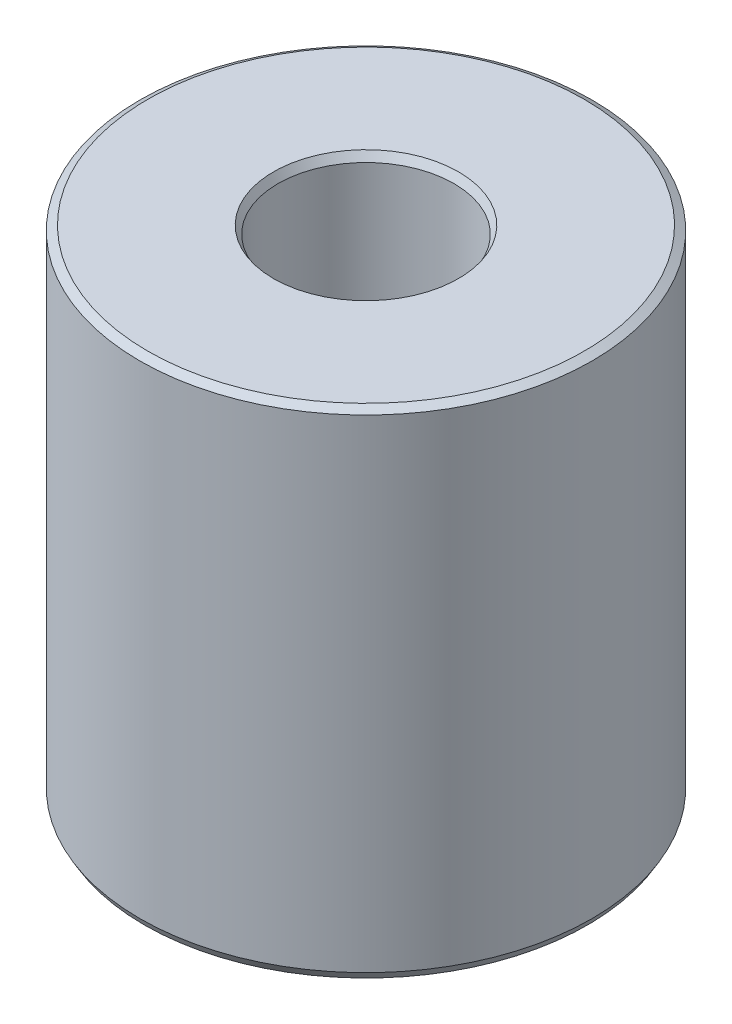
ISO-10303-21;
HEADER;
FILE_DESCRIPTION(('STEP AP214'),'2;1');
FILE_NAME('part.step','',(''),(''),'','','');
FILE_SCHEMA(('AUTOMOTIVE_DESIGN { 1 0 10303 214 1 1 1 1 }'));
ENDSEC;
DATA;
#1=APPLICATION_CONTEXT('core data for automotive mechanical design processes');
#2=APPLICATION_PROTOCOL_DEFINITION('international standard','automotive_design',2000,#1);
#3=PRODUCT_CONTEXT('',#1,'mechanical');
#4=PRODUCT('Part','Part','',(#3));
#5=PRODUCT_RELATED_PRODUCT_CATEGORY('part','',(#4));
#6=PRODUCT_DEFINITION_FORMATION('','',#4);
#7=PRODUCT_DEFINITION_CONTEXT('part definition',#1,'design');
#8=PRODUCT_DEFINITION('design','',#6,#7);
#9=PRODUCT_DEFINITION_SHAPE('','',#8);
#10=(LENGTH_UNIT() NAMED_UNIT(*) SI_UNIT(.MILLI.,.METRE.));
#11=(NAMED_UNIT(*) PLANE_ANGLE_UNIT() SI_UNIT($,.RADIAN.));
#12=(NAMED_UNIT(*) SI_UNIT($,.STERADIAN.) SOLID_ANGLE_UNIT());
#13=UNCERTAINTY_MEASURE_WITH_UNIT(LENGTH_MEASURE(1.E-05),#10,'distance_accuracy_value','');
#14=(GEOMETRIC_REPRESENTATION_CONTEXT(3) GLOBAL_UNCERTAINTY_ASSIGNED_CONTEXT((#13)) GLOBAL_UNIT_ASSIGNED_CONTEXT((#10,
#11,#12)) REPRESENTATION_CONTEXT('',''));
#15=CARTESIAN_POINT('',(0.,0.,0.));
#16=DIRECTION('',(0.,0.,1.));
#17=DIRECTION('',(1.,0.,0.));
#18=AXIS2_PLACEMENT_3D('',#15,#16,#17);
#19=CARTESIAN_POINT('',(0.,87.646396419652,0.));
#20=DIRECTION('',(0.,-1.,0.));
#21=DIRECTION('',(0.,0.,-1.));
#22=AXIS2_PLACEMENT_3D('',#19,#20,#21);
#23=CYLINDRICAL_SURFACE('',#22,40.);
#24=CARTESIAN_POINT('',(0.,1.39601108228643,0.));
#25=DIRECTION('',(0.,1.,0.));
#26=DIRECTION('',(0.,0.,1.));
#27=AXIS2_PLACEMENT_3D('',#24,#25,#26);
#28=CIRCLE('',#27,40.);
#29=CARTESIAN_POINT('',(0.,1.39601108228643,40.));
#30=VERTEX_POINT('',#29);
#31=EDGE_CURVE('E10',#30,#30,#28,.T.);
#32=ORIENTED_EDGE('',*,*,#31,.T.);
#33=EDGE_LOOP('',(#32));
#34=FACE_BOUND('',#33,.T.);
#35=CARTESIAN_POINT('',(0.,86.8404090455022,0.));
#36=DIRECTION('',(0.,1.,0.));
#37=DIRECTION('',(0.,0.,1.));
#38=AXIS2_PLACEMENT_3D('',#35,#36,#37);
#39=CIRCLE('',#38,40.);
#40=CARTESIAN_POINT('',(0.,86.8404090455022,40.));
#41=VERTEX_POINT('',#40);
#42=EDGE_CURVE('E50',#41,#41,#39,.F.);
#43=ORIENTED_EDGE('',*,*,#42,.T.);
#44=EDGE_LOOP('',(#43));
#45=FACE_BOUND('',#44,.T.);
#46=ADVANCED_FACE('F39',(#34,#45),#23,.T.);
#47=CARTESIAN_POINT('',(0.,87.646396419652,0.));
#48=DIRECTION('',(0.,1.,0.));
#49=DIRECTION('',(0.,0.,1.));
#50=AXIS2_PLACEMENT_3D('',#47,#48,#49);
#51=PLANE('',#50);
#52=CARTESIAN_POINT('',(0.,87.646396419652,0.));
#53=DIRECTION('',(0.,1.,0.));
#54=DIRECTION('',(0.,0.,1.));
#55=AXIS2_PLACEMENT_3D('',#52,#53,#54);
#56=CIRCLE('',#55,16.3695814343622);
#57=CARTESIAN_POINT('',(0.,87.6463964196519,16.3695814343622));
#58=VERTEX_POINT('',#57);
#59=EDGE_CURVE('E58',#58,#58,#56,.F.);
#60=ORIENTED_EDGE('',*,*,#59,.T.);
#61=EDGE_LOOP('',(#60));
#62=FACE_BOUND('',#61,.T.);
#63=CARTESIAN_POINT('',(0.,87.646396419652,0.));
#64=DIRECTION('',(0.,1.,0.));
#65=DIRECTION('',(0.,0.,1.));
#66=AXIS2_PLACEMENT_3D('',#63,#64,#65);
#67=CIRCLE('',#66,38.6039889177136);
#68=CARTESIAN_POINT('',(0.,87.646396419652,38.6039889177136));
#69=VERTEX_POINT('',#68);
#70=EDGE_CURVE('E61',#69,#69,#67,.T.);
#71=ORIENTED_EDGE('',*,*,#70,.T.);
#72=EDGE_LOOP('',(#71));
#73=FACE_BOUND('',#72,.T.);
#74=ADVANCED_FACE('F88',(#62,#73),#51,.T.);
#75=CARTESIAN_POINT('',(0.,0.,0.));
#76=DIRECTION('',(0.,1.,0.));
#77=DIRECTION('',(0.,0.,1.));
#78=AXIS2_PLACEMENT_3D('',#75,#76,#77);
#79=PLANE('',#78);
#80=CARTESIAN_POINT('',(0.,0.,0.));
#81=DIRECTION('',(0.,1.,0.));
#82=DIRECTION('',(0.,0.,1.));
#83=AXIS2_PLACEMENT_3D('',#80,#81,#82);
#84=CIRCLE('',#83,16.9596051424988);
#85=CARTESIAN_POINT('',(0.,0.,16.9596051424988));
#86=VERTEX_POINT('',#85);
#87=EDGE_CURVE('E51',#86,#86,#84,.T.);
#88=ORIENTED_EDGE('',*,*,#87,.T.);
#89=EDGE_LOOP('',(#88));
#90=FACE_BOUND('',#89,.T.);
#91=CARTESIAN_POINT('',(0.,0.,0.));
#92=DIRECTION('',(0.,1.,0.));
#93=DIRECTION('',(0.,0.,1.));
#94=AXIS2_PLACEMENT_3D('',#91,#92,#93);
#95=CIRCLE('',#94,39.1940126258502);
#96=CARTESIAN_POINT('',(0.,0.,39.1940126258502));
#97=VERTEX_POINT('',#96);
#98=EDGE_CURVE('E54',#97,#97,#95,.F.);
#99=ORIENTED_EDGE('',*,*,#98,.T.);
#100=EDGE_LOOP('',(#99));
#101=FACE_BOUND('',#100,.T.);
#102=ADVANCED_FACE('F83',(#90,#101),#79,.F.);
#103=CARTESIAN_POINT('',(0.,87.646396419652,0.));
#104=DIRECTION('',(0.,-1.,0.));
#105=DIRECTION('',(0.,0.,-1.));
#106=AXIS2_PLACEMENT_3D('',#103,#104,#105);
#107=CYLINDRICAL_SURFACE('',#106,15.5635940602124);
#108=CARTESIAN_POINT('',(0.,86.2503853373655,0.));
#109=DIRECTION('',(0.,1.,0.));
#110=DIRECTION('',(0.,0.,1.));
#111=AXIS2_PLACEMENT_3D('',#108,#109,#110);
#112=CIRCLE('',#111,15.5635940602124);
#113=CARTESIAN_POINT('',(0.,86.2503853373655,15.5635940602124));
#114=VERTEX_POINT('',#113);
#115=EDGE_CURVE('E67',#114,#114,#112,.T.);
#116=ORIENTED_EDGE('',*,*,#115,.T.);
#117=EDGE_LOOP('',(#116));
#118=FACE_BOUND('',#117,.T.);
#119=CARTESIAN_POINT('',(0.,0.805987374149789,0.));
#120=DIRECTION('',(0.,1.,0.));
#121=DIRECTION('',(0.,0.,1.));
#122=AXIS2_PLACEMENT_3D('',#119,#120,#121);
#123=CIRCLE('',#122,15.5635940602124);
#124=CARTESIAN_POINT('',(0.,0.805987374149789,15.5635940602124));
#125=VERTEX_POINT('',#124);
#126=EDGE_CURVE('E69',#125,#125,#123,.F.);
#127=ORIENTED_EDGE('',*,*,#126,.T.);
#128=EDGE_LOOP('',(#127));
#129=FACE_BOUND('',#128,.T.);
#130=ADVANCED_FACE('F71',(#118,#129),#107,.F.);
#131=CARTESIAN_POINT('',(0.,86.2503853373655,0.));
#132=DIRECTION('',(0.,1.,0.));
#133=DIRECTION('',(0.,0.,1.));
#134=AXIS2_PLACEMENT_3D('',#131,#132,#133);
#135=CONICAL_SURFACE('',#134,15.5635940602124,0.523598775598291);
#136=CARTESIAN_POINT('',(0.,87.6463964196519,16.3695814343622));
#137=CARTESIAN_POINT('',(0.,87.6318546375448,16.3611857325481));
#138=CARTESIAN_POINT('',(0.,87.6173128554377,16.352790030734));
#139=CARTESIAN_POINT('',(0.,87.5882292912234,16.3359986271059));
#140=CARTESIAN_POINT('',(0.,87.5736875091162,16.3276029252919));
#141=CARTESIAN_POINT('',(0.,87.5446039449019,16.3108115216637));
#142=CARTESIAN_POINT('',(0.,87.5300621627947,16.3024158198497));
#143=CARTESIAN_POINT('',(0.,87.5009785985805,16.2856244162216));
#144=CARTESIAN_POINT('',(0.,87.4864368164733,16.2772287144075));
#145=CARTESIAN_POINT('',(0.,87.457353252259,16.2604373107794));
#146=CARTESIAN_POINT('',(0.,87.4428114701519,16.2520416089653));
#147=CARTESIAN_POINT('',(0.,87.4137279059376,16.2352502053372));
#148=CARTESIAN_POINT('',(0.,87.3991861238304,16.2268545035231));
#149=CARTESIAN_POINT('',(0.,87.3701025596161,16.210063099895));
#150=CARTESIAN_POINT('',(0.,87.355560777509,16.201667398081));
#151=CARTESIAN_POINT('',(0.,87.3264772132947,16.1848759944528));
#152=CARTESIAN_POINT('',(0.,87.3119354311875,16.1764802926388));
#153=CARTESIAN_POINT('',(0.,87.2828518669732,16.1596888890107));
#154=CARTESIAN_POINT('',(0.,87.268310084866,16.1512931871966));
#155=CARTESIAN_POINT('',(0.,87.2392265206517,16.1345017835685));
#156=CARTESIAN_POINT('',(0.,87.2246847385446,16.1261060817544));
#157=CARTESIAN_POINT('',(0.,87.1956011743303,16.1093146781263));
#158=CARTESIAN_POINT('',(0.,87.1810593922231,16.1009189763122));
#159=CARTESIAN_POINT('',(0.,87.1519758280088,16.0841275726841));
#160=CARTESIAN_POINT('',(0.,87.1374340459017,16.0757318708701));
#161=CARTESIAN_POINT('',(0.,87.1083504816874,16.0589404672419));
#162=CARTESIAN_POINT('',(0.,87.0938086995803,16.0505447654279));
#163=CARTESIAN_POINT('',(0.,87.0647251353659,16.0337533617998));
#164=CARTESIAN_POINT('',(0.,87.0501833532588,16.0253576599857));
#165=CARTESIAN_POINT('',(0.,87.0210997890445,16.0085662563576));
#166=CARTESIAN_POINT('',(0.,87.0065580069374,16.0001705545435));
#167=CARTESIAN_POINT('',(0.,86.9774744427231,15.9833791509154));
#168=CARTESIAN_POINT('',(0.,86.9629326606159,15.9749834491013));
#169=CARTESIAN_POINT('',(0.,86.9338490964016,15.9581920454732));
#170=CARTESIAN_POINT('',(0.,86.9193073142944,15.9497963436592));
#171=CARTESIAN_POINT('',(0.,86.8902237500801,15.933004940031));
#172=CARTESIAN_POINT('',(0.,86.875681967973,15.924609238217));
#173=CARTESIAN_POINT('',(0.,86.8465984037587,15.9078178345889));
#174=CARTESIAN_POINT('',(0.,86.8320566216515,15.8994221327748));
#175=CARTESIAN_POINT('',(0.,86.8029730574372,15.8826307291467));
#176=CARTESIAN_POINT('',(0.,86.7884312753301,15.8742350273326));
#177=CARTESIAN_POINT('',(0.,86.7593477111158,15.8574436237045));
#178=CARTESIAN_POINT('',(0.,86.7448059290086,15.8490479218904));
#179=CARTESIAN_POINT('',(0.,86.7157223647943,15.8322565182623));
#180=CARTESIAN_POINT('',(0.,86.7011805826872,15.8238608164483));
#181=CARTESIAN_POINT('',(0.,86.6720970184729,15.8070694128201));
#182=CARTESIAN_POINT('',(0.,86.6575552363657,15.7986737110061));
#183=CARTESIAN_POINT('',(0.,86.6284716721514,15.781882307378));
#184=CARTESIAN_POINT('',(0.,86.6139298900443,15.7734866055639));
#185=CARTESIAN_POINT('',(0.,86.58484632583,15.7566952019358));
#186=CARTESIAN_POINT('',(0.,86.5703045437228,15.7482995001217));
#187=CARTESIAN_POINT('',(0.,86.5412209795085,15.7315080964936));
#188=CARTESIAN_POINT('',(0.,86.5266791974014,15.7231123946795));
#189=CARTESIAN_POINT('',(0.,86.4975956331871,15.7063209910514));
#190=CARTESIAN_POINT('',(0.,86.4830538510799,15.6979252892374));
#191=CARTESIAN_POINT('',(0.,86.4539702868656,15.6811338856092));
#192=CARTESIAN_POINT('',(0.,86.4394285047585,15.6727381837952));
#193=CARTESIAN_POINT('',(0.,86.4103449405442,15.6559467801671));
#194=CARTESIAN_POINT('',(0.,86.395803158437,15.647551078353));
#195=CARTESIAN_POINT('',(0.,86.3667195942227,15.6307596747249));
#196=CARTESIAN_POINT('',(0.,86.3521778121156,15.6223639729108));
#197=CARTESIAN_POINT('',(0.,86.3230942479013,15.6055725692827));
#198=CARTESIAN_POINT('',(0.,86.3085524657941,15.5971768674686));
#199=CARTESIAN_POINT('',(0.,86.2794689015798,15.5803854638405));
#200=CARTESIAN_POINT('',(0.,86.2649271194727,15.5719897620265));
#201=CARTESIAN_POINT('',(0.,86.2503853373655,15.5635940602124));
#202=B_SPLINE_CURVE_WITH_KNOTS('',3,(#136,#137,#138,#139,#140,#141,#142,#143,#144,#145,#146,
#147,#148,#149,#150,#151,#152,#153,#154,#155,#156,#157,#158,#159,#160,#161,#162,#163,#164,#165,
#166,#167,#168,#169,#170,#171,#172,#173,#174,#175,#176,#177,#178,#179,#180,#181,#182,#183,#184,
#185,#186,#187,#188,#189,#190,#191,#192,#193,#194,#195,#196,#197,#198,#199,#200,#201),
.UNSPECIFIED.,.F.,.F.,(4,2,2,2,2,2,2,2,2,2,2,2,2,2,2,2,2,2,2,2,2,2,2,2,2,2,2,2,2,2,2,2,4),(0.,
0.0503742108843584,0.100748421768719,0.151122632653077,0.201496843537435,0.251871054421795,
0.302245265306154,0.352619476190514,0.402993687074884,0.453367897959243,0.503742108843603,
0.554116319727961,0.60449053061232,0.65486474149668,0.705238952381038,0.755613163265397,
0.805987374149769,0.856361585034127,0.906735795918486,0.957110006802846,1.0074842176872,
1.05785842857156,1.10823263945592,1.15860685034028,1.20898106122465,1.25935527210901,
1.30972948299337,1.36010369387773,1.41047790476209,1.46085211564645,1.51122632653081,
1.56160053741516,1.61197474829952),.UNSPECIFIED.);
#203=EDGE_CURVE('BSEAM77',#58,#114,#202,.T.);
#204=ORIENTED_EDGE('',*,*,#59,.F.);
#205=ORIENTED_EDGE('',*,*,#115,.F.);
#206=ORIENTED_EDGE('',*,*,#203,.T.);
#207=ORIENTED_EDGE('',*,*,#203,.F.);
#208=EDGE_LOOP('',(#204,#206,#205,#207));
#209=FACE_BOUND('',#208,.T.);
#210=ADVANCED_FACE('F77',(#209),#135,.F.);
#211=CARTESIAN_POINT('',(0.,0.,0.));
#212=DIRECTION('',(0.,-1.,0.));
#213=DIRECTION('',(0.,0.,-1.));
#214=AXIS2_PLACEMENT_3D('',#211,#212,#213);
#215=CONICAL_SURFACE('',#214,16.9596051424988,1.04719755119659);
#216=ORIENTED_EDGE('',*,*,#126,.F.);
#217=EDGE_LOOP('',(#216));
#218=FACE_BOUND('',#217,.T.);
#219=ORIENTED_EDGE('',*,*,#87,.F.);
#220=EDGE_LOOP('',(#219));
#221=FACE_BOUND('',#220,.T.);
#222=ADVANCED_FACE('F73',(#218,#221),#215,.F.);
#223=CARTESIAN_POINT('',(0.,1.39601108228643,0.));
#224=DIRECTION('',(0.,1.,0.));
#225=DIRECTION('',(0.,0.,1.));
#226=AXIS2_PLACEMENT_3D('',#223,#224,#225);
#227=CONICAL_SURFACE('',#226,40.,0.523598775598308);
#228=CARTESIAN_POINT('',(0.,0.,39.1940126258502));
#229=CARTESIAN_POINT('',(0.,0.0145417821071515,39.2024083276643));
#230=CARTESIAN_POINT('',(0.,0.0290835642143014,39.2108040294783));
#231=CARTESIAN_POINT('',(0.,0.0581671284286011,39.2275954331065));
#232=CARTESIAN_POINT('',(0.,0.0727089105357509,39.2359911349205));
#233=CARTESIAN_POINT('',(0.,0.101792474750051,39.2527825385486));
#234=CARTESIAN_POINT('',(0.,0.116334256857202,39.2611782403627));
#235=CARTESIAN_POINT('',(0.,0.145417821071503,39.2779696439908));
#236=CARTESIAN_POINT('',(0.,0.159959603178654,39.2863653458049));
#237=CARTESIAN_POINT('',(0.,0.189043167392954,39.303156749433));
#238=CARTESIAN_POINT('',(0.,0.203584949500104,39.3115524512471));
#239=CARTESIAN_POINT('',(0.,0.232668513714404,39.3283438548752));
#240=CARTESIAN_POINT('',(0.,0.247210295821555,39.3367395566892));
#241=CARTESIAN_POINT('',(0.,0.276293860035856,39.3535309603174));
#242=CARTESIAN_POINT('',(0.,0.290835642143006,39.3619266621314));
#243=CARTESIAN_POINT('',(0.,0.319919206357307,39.3787180657595));
#244=CARTESIAN_POINT('',(0.,0.334460988464458,39.3871137675736));
#245=CARTESIAN_POINT('',(0.,0.363544552678758,39.4039051712017));
#246=CARTESIAN_POINT('',(0.,0.378086334785908,39.4123008730158));
#247=CARTESIAN_POINT('',(0.,0.407169899000208,39.4290922766439));
#248=CARTESIAN_POINT('',(0.,0.421711681107359,39.437487978458));
#249=CARTESIAN_POINT('',(0.,0.45079524532166,39.4542793820861));
#250=CARTESIAN_POINT('',(0.,0.46533702742881,39.4626750839001));
#251=CARTESIAN_POINT('',(0.,0.494420591643111,39.4794664875283));
#252=CARTESIAN_POINT('',(0.,0.50896237375026,39.4878621893423));
#253=CARTESIAN_POINT('',(0.,0.538045937964561,39.5046535929704));
#254=CARTESIAN_POINT('',(0.,0.552587720071711,39.5130492947845));
#255=CARTESIAN_POINT('',(0.,0.581671284286013,39.5298406984126));
#256=CARTESIAN_POINT('',(0.,0.596213066393163,39.5382364002267));
#257=CARTESIAN_POINT('',(0.,0.625296630607464,39.5550278038548));
#258=CARTESIAN_POINT('',(0.,0.639838412714613,39.5634235056689));
#259=CARTESIAN_POINT('',(0.,0.668921976928914,39.580214909297));
#260=CARTESIAN_POINT('',(0.,0.683463759036064,39.588610611111));
#261=CARTESIAN_POINT('',(0.,0.712547323250366,39.6054020147392));
#262=CARTESIAN_POINT('',(0.,0.727089105357516,39.6137977165532));
#263=CARTESIAN_POINT('',(0.,0.756172669571816,39.6305891201813));
#264=CARTESIAN_POINT('',(0.,0.770714451678966,39.6389848219954));
#265=CARTESIAN_POINT('',(0.,0.799798015893266,39.6557762256235));
#266=CARTESIAN_POINT('',(0.,0.814339798000417,39.6641719274376));
#267=CARTESIAN_POINT('',(0.,0.843423362214718,39.6809633310657));
#268=CARTESIAN_POINT('',(0.,0.857965144321869,39.6893590328798));
#269=CARTESIAN_POINT('',(0.,0.887048708536169,39.7061504365079));
#270=CARTESIAN_POINT('',(0.,0.901590490643319,39.714546138322));
#271=CARTESIAN_POINT('',(0.,0.930674054857619,39.7313375419501));
#272=CARTESIAN_POINT('',(0.,0.94521583696477,39.7397332437641));
#273=CARTESIAN_POINT('',(0.,0.974299401179071,39.7565246473923));
#274=CARTESIAN_POINT('',(0.,0.988841183286221,39.7649203492063));
#275=CARTESIAN_POINT('',(0.,1.01792474750052,39.7817117528344));
#276=CARTESIAN_POINT('',(0.,1.03246652960767,39.7901074546485));
#277=CARTESIAN_POINT('',(0.,1.06155009382197,39.8068988582766));
#278=CARTESIAN_POINT('',(0.,1.07609187592912,39.8152945600907));
#279=CARTESIAN_POINT('',(0.,1.10517544014342,39.8320859637188));
#280=CARTESIAN_POINT('',(0.,1.11971722225057,39.8404816655329));
#281=CARTESIAN_POINT('',(0.,1.14880078646488,39.857273069161));
#282=CARTESIAN_POINT('',(0.,1.16334256857203,39.865668770975));
#283=CARTESIAN_POINT('',(0.,1.19242613278633,39.8824601746032));
#284=CARTESIAN_POINT('',(0.,1.20696791489348,39.8908558764172));
#285=CARTESIAN_POINT('',(0.,1.23605147910778,39.9076472800453));
#286=CARTESIAN_POINT('',(0.,1.25059326121493,39.9160429818594));
#287=CARTESIAN_POINT('',(0.,1.27967682542923,39.9328343854875));
#288=CARTESIAN_POINT('',(0.,1.29421860753638,39.9412300873016));
#289=CARTESIAN_POINT('',(0.,1.32330217175068,39.9580214909297));
#290=CARTESIAN_POINT('',(0.,1.33784395385783,39.9664171927438));
#291=CARTESIAN_POINT('',(0.,1.36692751807213,39.9832085963719));
#292=CARTESIAN_POINT('',(0.,1.38146930017928,39.9916042981859));
#293=CARTESIAN_POINT('',(0.,1.39601108228643,40.));
#294=B_SPLINE_CURVE_WITH_KNOTS('',3,(#228,#229,#230,#231,#232,#233,#234,#235,#236,#237,#238,
#239,#240,#241,#242,#243,#244,#245,#246,#247,#248,#249,#250,#251,#252,#253,#254,#255,#256,#257,
#258,#259,#260,#261,#262,#263,#264,#265,#266,#267,#268,#269,#270,#271,#272,#273,#274,#275,#276,
#277,#278,#279,#280,#281,#282,#283,#284,#285,#286,#287,#288,#289,#290,#291,#292,#293),
.UNSPECIFIED.,.F.,.F.,(4,2,2,2,2,2,2,2,2,2,2,2,2,2,2,2,2,2,2,2,2,2,2,2,2,2,2,2,2,2,2,2,4),(0.,
0.0503742108843599,0.100748421768723,0.151122632653083,0.201496843537443,0.251871054421806,
0.302245265306166,0.352619476190526,0.402993687074886,0.453367897959249,0.503742108843609,
0.554116319727969,0.604490530612332,0.654864741496692,0.705238952381052,0.755613163265415,
0.805987374149775,0.856361585034135,0.906735795918499,0.957110006802858,1.00748421768722,
1.05785842857158,1.10823263945594,1.1586068503403,1.20898106122466,1.25935527210902,
1.30972948299338,1.36010369387774,1.41047790476211,1.46085211564647,1.51122632653083,
1.56160053741519,1.61197474829955),.UNSPECIFIED.);
#295=EDGE_CURVE('BSEAM76',#97,#30,#294,.T.);
#296=ORIENTED_EDGE('',*,*,#98,.F.);
#297=ORIENTED_EDGE('',*,*,#31,.F.);
#298=ORIENTED_EDGE('',*,*,#295,.T.);
#299=ORIENTED_EDGE('',*,*,#295,.F.);
#300=EDGE_LOOP('',(#296,#298,#297,#299));
#301=FACE_BOUND('',#300,.T.);
#302=ADVANCED_FACE('F76',(#301),#227,.T.);
#303=CARTESIAN_POINT('',(0.,87.646396419652,0.));
#304=DIRECTION('',(0.,-1.,0.));
#305=DIRECTION('',(0.,0.,-1.));
#306=AXIS2_PLACEMENT_3D('',#303,#304,#305);
#307=CONICAL_SURFACE('',#306,38.6039889177136,1.0471975511966);
#308=ORIENTED_EDGE('',*,*,#42,.F.);
#309=EDGE_LOOP('',(#308));
#310=FACE_BOUND('',#309,.T.);
#311=ORIENTED_EDGE('',*,*,#70,.F.);
#312=EDGE_LOOP('',(#311));
#313=FACE_BOUND('',#312,.T.);
#314=ADVANCED_FACE('F45',(#310,#313),#307,.T.);
#315=CLOSED_SHELL('',(#46,#74,#102,#130,#210,#222,#302,#314));
#316=MANIFOLD_SOLID_BREP('B2',#315);
#317=ADVANCED_BREP_SHAPE_REPRESENTATION('',(#18,#316),#14);
#318=SHAPE_DEFINITION_REPRESENTATION(#9,#317);
ENDSEC;
END-ISO-10303-21;
